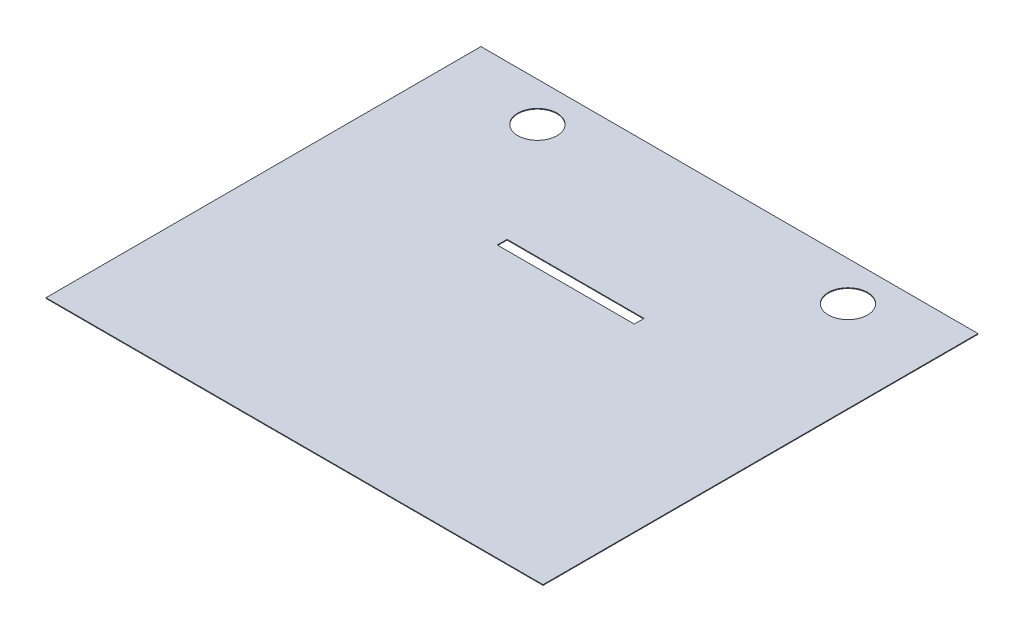
ISO-10303-21;
HEADER;
FILE_DESCRIPTION(('STEP AP214'),'2;1');
FILE_NAME('part.step','',(''),(''),'','','');
FILE_SCHEMA(('AUTOMOTIVE_DESIGN { 1 0 10303 214 1 1 1 1 }'));
ENDSEC;
DATA;
#1=APPLICATION_CONTEXT('core data for automotive mechanical design processes');
#2=APPLICATION_PROTOCOL_DEFINITION('international standard','automotive_design',2000,#1);
#3=PRODUCT_CONTEXT('',#1,'mechanical');
#4=PRODUCT('Part','Part','',(#3));
#5=PRODUCT_RELATED_PRODUCT_CATEGORY('part','',(#4));
#6=PRODUCT_DEFINITION_FORMATION('','',#4);
#7=PRODUCT_DEFINITION_CONTEXT('part definition',#1,'design');
#8=PRODUCT_DEFINITION('design','',#6,#7);
#9=PRODUCT_DEFINITION_SHAPE('','',#8);
#10=(LENGTH_UNIT() NAMED_UNIT(*) SI_UNIT(.MILLI.,.METRE.));
#11=(NAMED_UNIT(*) PLANE_ANGLE_UNIT() SI_UNIT($,.RADIAN.));
#12=(NAMED_UNIT(*) SI_UNIT($,.STERADIAN.) SOLID_ANGLE_UNIT());
#13=UNCERTAINTY_MEASURE_WITH_UNIT(LENGTH_MEASURE(1.E-05),#10,'distance_accuracy_value','');
#14=(GEOMETRIC_REPRESENTATION_CONTEXT(3) GLOBAL_UNCERTAINTY_ASSIGNED_CONTEXT((#13)) GLOBAL_UNIT_ASSIGNED_CONTEXT((#10,
#11,#12)) REPRESENTATION_CONTEXT('',''));
#15=CARTESIAN_POINT('',(0.,0.,0.));
#16=DIRECTION('',(0.,0.,1.));
#17=DIRECTION('',(1.,0.,0.));
#18=AXIS2_PLACEMENT_3D('',#15,#16,#17);
#19=CARTESIAN_POINT('',(0.,-0.07,-44.45));
#20=DIRECTION('',(-1.,0.,0.));
#21=DIRECTION('',(0.,0.,1.));
#22=AXIS2_PLACEMENT_3D('',#19,#20,#21);
#23=PLANE('',#22);
#24=DIRECTION('',(0.,0.,1.));
#25=VECTOR('',#24,1.);
#26=CARTESIAN_POINT('',(0.,0.,-44.45));
#27=LINE('',#26,#25);
#28=CARTESIAN_POINT('',(0.,0.,-44.45));
#29=VERTEX_POINT('',#28);
#30=CARTESIAN_POINT('',(0.,0.,0.));
#31=VERTEX_POINT('',#30);
#32=EDGE_CURVE('E166',#29,#31,#27,.T.);
#33=ORIENTED_EDGE('',*,*,#32,.F.);
#34=DIRECTION('',(0.,1.,0.));
#35=VECTOR('',#34,1.);
#36=CARTESIAN_POINT('',(0.,-0.07,-44.45));
#37=LINE('',#36,#35);
#38=CARTESIAN_POINT('',(0.,-0.07,-44.45));
#39=VERTEX_POINT('',#38);
#40=EDGE_CURVE('E11',#39,#29,#37,.T.);
#41=ORIENTED_EDGE('',*,*,#40,.F.);
#42=DIRECTION('',(0.,0.,1.));
#43=VECTOR('',#42,1.);
#44=CARTESIAN_POINT('',(0.,-0.07,-44.45));
#45=LINE('',#44,#43);
#46=CARTESIAN_POINT('',(0.,-0.07,0.));
#47=VERTEX_POINT('',#46);
#48=EDGE_CURVE('E170',#39,#47,#45,.T.);
#49=ORIENTED_EDGE('',*,*,#48,.T.);
#50=DIRECTION('',(0.,1.,0.));
#51=VECTOR('',#50,1.);
#52=CARTESIAN_POINT('',(0.,-0.07,0.));
#53=LINE('',#52,#51);
#54=EDGE_CURVE('E42',#47,#31,#53,.T.);
#55=ORIENTED_EDGE('',*,*,#54,.T.);
#56=EDGE_LOOP('',(#33,#41,#49,#55));
#57=FACE_BOUND('',#56,.T.);
#58=ADVANCED_FACE('F39',(#57),#23,.T.);
#59=CARTESIAN_POINT('',(0.,-0.07,-44.45));
#60=DIRECTION('',(0.,0.,-1.));
#61=DIRECTION('',(-1.,0.,0.));
#62=AXIS2_PLACEMENT_3D('',#59,#60,#61);
#63=PLANE('',#62);
#64=DIRECTION('',(-1.,0.,0.));
#65=VECTOR('',#64,1.);
#66=CARTESIAN_POINT('',(0.,0.,-44.45));
#67=LINE('',#66,#65);
#68=CARTESIAN_POINT('',(50.8,0.,-44.45));
#69=VERTEX_POINT('',#68);
#70=EDGE_CURVE('E175',#69,#29,#67,.T.);
#71=ORIENTED_EDGE('',*,*,#70,.F.);
#72=DIRECTION('',(0.,1.,0.));
#73=VECTOR('',#72,1.);
#74=CARTESIAN_POINT('',(50.8,-0.07,-44.45));
#75=LINE('',#74,#73);
#76=CARTESIAN_POINT('',(50.8,-0.07,-44.45));
#77=VERTEX_POINT('',#76);
#78=EDGE_CURVE('E48',#77,#69,#75,.T.);
#79=ORIENTED_EDGE('',*,*,#78,.F.);
#80=DIRECTION('',(-1.,0.,0.));
#81=VECTOR('',#80,1.);
#82=CARTESIAN_POINT('',(0.,-0.07,-44.45));
#83=LINE('',#82,#81);
#84=EDGE_CURVE('E183',#77,#39,#83,.T.);
#85=ORIENTED_EDGE('',*,*,#84,.T.);
#86=ORIENTED_EDGE('',*,*,#40,.T.);
#87=EDGE_LOOP('',(#71,#79,#85,#86));
#88=FACE_BOUND('',#87,.T.);
#89=ADVANCED_FACE('F217',(#88),#63,.T.);
#90=CARTESIAN_POINT('',(50.8,-0.07,-44.45));
#91=DIRECTION('',(1.,0.,0.));
#92=DIRECTION('',(0.,0.,-1.));
#93=AXIS2_PLACEMENT_3D('',#90,#91,#92);
#94=PLANE('',#93);
#95=DIRECTION('',(0.,0.,-1.));
#96=VECTOR('',#95,1.);
#97=CARTESIAN_POINT('',(50.8,0.,-44.45));
#98=LINE('',#97,#96);
#99=CARTESIAN_POINT('',(50.8,0.,0.));
#100=VERTEX_POINT('',#99);
#101=EDGE_CURVE('E194',#100,#69,#98,.T.);
#102=ORIENTED_EDGE('',*,*,#101,.F.);
#103=DIRECTION('',(0.,1.,0.));
#104=VECTOR('',#103,1.);
#105=CARTESIAN_POINT('',(50.8,-0.07,0.));
#106=LINE('',#105,#104);
#107=CARTESIAN_POINT('',(50.8,-0.07,0.));
#108=VERTEX_POINT('',#107);
#109=EDGE_CURVE('E202',#108,#100,#106,.T.);
#110=ORIENTED_EDGE('',*,*,#109,.F.);
#111=DIRECTION('',(0.,0.,-1.));
#112=VECTOR('',#111,1.);
#113=CARTESIAN_POINT('',(50.8,-0.07,-44.45));
#114=LINE('',#113,#112);
#115=EDGE_CURVE('E179',#108,#77,#114,.T.);
#116=ORIENTED_EDGE('',*,*,#115,.T.);
#117=ORIENTED_EDGE('',*,*,#78,.T.);
#118=EDGE_LOOP('',(#102,#110,#116,#117));
#119=FACE_BOUND('',#118,.T.);
#120=ADVANCED_FACE('F222',(#119),#94,.T.);
#121=CARTESIAN_POINT('',(0.,-0.07,0.));
#122=DIRECTION('',(0.,0.,1.));
#123=DIRECTION('',(1.,0.,0.));
#124=AXIS2_PLACEMENT_3D('',#121,#122,#123);
#125=PLANE('',#124);
#126=DIRECTION('',(1.,0.,0.));
#127=VECTOR('',#126,1.);
#128=CARTESIAN_POINT('',(0.,0.,0.));
#129=LINE('',#128,#127);
#130=EDGE_CURVE('E190',#31,#100,#129,.T.);
#131=ORIENTED_EDGE('',*,*,#130,.F.);
#132=ORIENTED_EDGE('',*,*,#54,.F.);
#133=DIRECTION('',(1.,0.,0.));
#134=VECTOR('',#133,1.);
#135=CARTESIAN_POINT('',(0.,-0.07,0.));
#136=LINE('',#135,#134);
#137=EDGE_CURVE('E174',#47,#108,#136,.T.);
#138=ORIENTED_EDGE('',*,*,#137,.T.);
#139=ORIENTED_EDGE('',*,*,#109,.T.);
#140=EDGE_LOOP('',(#131,#132,#138,#139));
#141=FACE_BOUND('',#140,.T.);
#142=ADVANCED_FACE('F212',(#141),#125,.T.);
#143=CARTESIAN_POINT('',(0.,-0.07,0.));
#144=DIRECTION('',(0.,1.,0.));
#145=DIRECTION('',(0.,0.,1.));
#146=AXIS2_PLACEMENT_3D('',#143,#144,#145);
#147=PLANE('',#146);
#148=DIRECTION('',(-1.,0.,0.));
#149=VECTOR('',#148,1.);
#150=CARTESIAN_POINT('',(18.4,-0.07,-28.725));
#151=LINE('',#150,#149);
#152=CARTESIAN_POINT('',(32.4,-0.07,-28.725));
#153=VERTEX_POINT('',#152);
#154=CARTESIAN_POINT('',(18.4,-0.07,-28.725));
#155=VERTEX_POINT('',#154);
#156=EDGE_CURVE('E114',#153,#155,#151,.T.);
#157=ORIENTED_EDGE('',*,*,#156,.T.);
#158=DIRECTION('',(0.,0.,1.));
#159=VECTOR('',#158,1.);
#160=CARTESIAN_POINT('',(18.4,-0.07,-28.725));
#161=LINE('',#160,#159);
#162=CARTESIAN_POINT('',(18.4,-0.07,-27.725));
#163=VERTEX_POINT('',#162);
#164=EDGE_CURVE('E107',#155,#163,#161,.T.);
#165=ORIENTED_EDGE('',*,*,#164,.T.);
#166=DIRECTION('',(1.,0.,0.));
#167=VECTOR('',#166,1.);
#168=CARTESIAN_POINT('',(18.4,-0.07,-27.725));
#169=LINE('',#168,#167);
#170=CARTESIAN_POINT('',(32.4,-0.07,-27.725));
#171=VERTEX_POINT('',#170);
#172=EDGE_CURVE('E117',#163,#171,#169,.T.);
#173=ORIENTED_EDGE('',*,*,#172,.T.);
#174=DIRECTION('',(0.,0.,-1.));
#175=VECTOR('',#174,1.);
#176=CARTESIAN_POINT('',(32.4,-0.07,-28.725));
#177=LINE('',#176,#175);
#178=EDGE_CURVE('E56',#171,#153,#177,.T.);
#179=ORIENTED_EDGE('',*,*,#178,.T.);
#180=EDGE_LOOP('',(#157,#165,#173,#179));
#181=FACE_BOUND('',#180,.T.);
#182=CARTESIAN_POINT('',(41.5128674030477,-0.07,-40.45));
#183=DIRECTION('',(0.,1.,0.));
#184=DIRECTION('',(0.,0.,1.));
#185=AXIS2_PLACEMENT_3D('',#182,#183,#184);
#186=CIRCLE('',#185,2.);
#187=CARTESIAN_POINT('',(41.5128674030477,-0.07,-38.45));
#188=VERTEX_POINT('',#187);
#189=EDGE_CURVE('E154',#188,#188,#186,.T.);
#190=ORIENTED_EDGE('',*,*,#189,.T.);
#191=EDGE_LOOP('',(#190));
#192=FACE_BOUND('',#191,.T.);
#193=CARTESIAN_POINT('',(9.77268378326401,-0.07,-40.45));
#194=DIRECTION('',(0.,1.,0.));
#195=DIRECTION('',(0.,0.,1.));
#196=AXIS2_PLACEMENT_3D('',#193,#194,#195);
#197=CIRCLE('',#196,2.00128013533751);
#198=CARTESIAN_POINT('',(9.77268378326401,-0.07,-38.4487198646625));
#199=VERTEX_POINT('',#198);
#200=EDGE_CURVE('E162',#199,#199,#197,.T.);
#201=ORIENTED_EDGE('',*,*,#200,.T.);
#202=EDGE_LOOP('',(#201));
#203=FACE_BOUND('',#202,.T.);
#204=ORIENTED_EDGE('',*,*,#48,.F.);
#205=ORIENTED_EDGE('',*,*,#84,.F.);
#206=ORIENTED_EDGE('',*,*,#115,.F.);
#207=ORIENTED_EDGE('',*,*,#137,.F.);
#208=EDGE_LOOP('',(#204,#205,#206,#207));
#209=FACE_BOUND('',#208,.T.);
#210=ADVANCED_FACE('F122',(#181,#192,#203,#209),#147,.F.);
#211=CARTESIAN_POINT('',(0.,0.,0.));
#212=DIRECTION('',(0.,1.,0.));
#213=DIRECTION('',(0.,0.,1.));
#214=AXIS2_PLACEMENT_3D('',#211,#212,#213);
#215=PLANE('',#214);
#216=DIRECTION('',(0.,0.,1.));
#217=VECTOR('',#216,1.);
#218=CARTESIAN_POINT('',(18.4,0.,-28.725));
#219=LINE('',#218,#217);
#220=CARTESIAN_POINT('',(18.4,0.,-28.725));
#221=VERTEX_POINT('',#220);
#222=CARTESIAN_POINT('',(18.4,0.,-27.725));
#223=VERTEX_POINT('',#222);
#224=EDGE_CURVE('E64',#221,#223,#219,.T.);
#225=ORIENTED_EDGE('',*,*,#224,.F.);
#226=DIRECTION('',(-1.,0.,0.));
#227=VECTOR('',#226,1.);
#228=CARTESIAN_POINT('',(18.4,0.,-28.725));
#229=LINE('',#228,#227);
#230=CARTESIAN_POINT('',(32.4,0.,-28.725));
#231=VERTEX_POINT('',#230);
#232=EDGE_CURVE('E126',#231,#221,#229,.T.);
#233=ORIENTED_EDGE('',*,*,#232,.F.);
#234=DIRECTION('',(0.,0.,-1.));
#235=VECTOR('',#234,1.);
#236=CARTESIAN_POINT('',(32.4,0.,-28.725));
#237=LINE('',#236,#235);
#238=CARTESIAN_POINT('',(32.4,0.,-27.725));
#239=VERTEX_POINT('',#238);
#240=EDGE_CURVE('E130',#239,#231,#237,.T.);
#241=ORIENTED_EDGE('',*,*,#240,.F.);
#242=DIRECTION('',(1.,0.,0.));
#243=VECTOR('',#242,1.);
#244=CARTESIAN_POINT('',(18.4,0.,-27.725));
#245=LINE('',#244,#243);
#246=EDGE_CURVE('E139',#223,#239,#245,.T.);
#247=ORIENTED_EDGE('',*,*,#246,.F.);
#248=EDGE_LOOP('',(#225,#233,#241,#247));
#249=FACE_BOUND('',#248,.T.);
#250=CARTESIAN_POINT('',(41.5128674030477,0.,-40.45));
#251=DIRECTION('',(0.,1.,0.));
#252=DIRECTION('',(0.,0.,1.));
#253=AXIS2_PLACEMENT_3D('',#250,#251,#252);
#254=CIRCLE('',#253,2.);
#255=CARTESIAN_POINT('',(41.5128674030477,0.,-38.45));
#256=VERTEX_POINT('',#255);
#257=EDGE_CURVE('E148',#256,#256,#254,.T.);
#258=ORIENTED_EDGE('',*,*,#257,.F.);
#259=EDGE_LOOP('',(#258));
#260=FACE_BOUND('',#259,.T.);
#261=CARTESIAN_POINT('',(9.77268378326401,0.,-40.45));
#262=DIRECTION('',(0.,1.,0.));
#263=DIRECTION('',(0.,0.,1.));
#264=AXIS2_PLACEMENT_3D('',#261,#262,#263);
#265=CIRCLE('',#264,2.00128013533751);
#266=CARTESIAN_POINT('',(9.77268378326401,0.,-38.4487198646625));
#267=VERTEX_POINT('',#266);
#268=EDGE_CURVE('E158',#267,#267,#265,.T.);
#269=ORIENTED_EDGE('',*,*,#268,.F.);
#270=EDGE_LOOP('',(#269));
#271=FACE_BOUND('',#270,.T.);
#272=ORIENTED_EDGE('',*,*,#32,.T.);
#273=ORIENTED_EDGE('',*,*,#130,.T.);
#274=ORIENTED_EDGE('',*,*,#101,.T.);
#275=ORIENTED_EDGE('',*,*,#70,.T.);
#276=EDGE_LOOP('',(#272,#273,#274,#275));
#277=FACE_BOUND('',#276,.T.);
#278=ADVANCED_FACE('F214',(#249,#260,#271,#277),#215,.T.);
#279=CARTESIAN_POINT('',(9.77268378326401,-0.07,-40.45));
#280=DIRECTION('',(0.,1.,0.));
#281=DIRECTION('',(0.,0.,1.));
#282=AXIS2_PLACEMENT_3D('',#279,#280,#281);
#283=CYLINDRICAL_SURFACE('',#282,2.00128013533751);
#284=ORIENTED_EDGE('',*,*,#200,.F.);
#285=EDGE_LOOP('',(#284));
#286=FACE_BOUND('',#285,.T.);
#287=ORIENTED_EDGE('',*,*,#268,.T.);
#288=EDGE_LOOP('',(#287));
#289=FACE_BOUND('',#288,.T.);
#290=ADVANCED_FACE('F264',(#286,#289),#283,.F.);
#291=CARTESIAN_POINT('',(41.5128674030477,-0.07,-40.45));
#292=DIRECTION('',(0.,1.,0.));
#293=DIRECTION('',(0.,0.,1.));
#294=AXIS2_PLACEMENT_3D('',#291,#292,#293);
#295=CYLINDRICAL_SURFACE('',#294,2.);
#296=ORIENTED_EDGE('',*,*,#189,.F.);
#297=EDGE_LOOP('',(#296));
#298=FACE_BOUND('',#297,.T.);
#299=ORIENTED_EDGE('',*,*,#257,.T.);
#300=EDGE_LOOP('',(#299));
#301=FACE_BOUND('',#300,.T.);
#302=ADVANCED_FACE('F274',(#298,#301),#295,.F.);
#303=CARTESIAN_POINT('',(18.4,-0.07,-28.725));
#304=DIRECTION('',(-1.,0.,0.));
#305=DIRECTION('',(0.,0.,1.));
#306=AXIS2_PLACEMENT_3D('',#303,#304,#305);
#307=PLANE('',#306);
#308=ORIENTED_EDGE('',*,*,#224,.T.);
#309=DIRECTION('',(0.,1.,0.));
#310=VECTOR('',#309,1.);
#311=CARTESIAN_POINT('',(18.4,-0.07,-27.725));
#312=LINE('',#311,#310);
#313=EDGE_CURVE('E103',#163,#223,#312,.T.);
#314=ORIENTED_EDGE('',*,*,#313,.F.);
#315=ORIENTED_EDGE('',*,*,#164,.F.);
#316=DIRECTION('',(0.,1.,0.));
#317=VECTOR('',#316,1.);
#318=CARTESIAN_POINT('',(18.4,-0.07,-28.725));
#319=LINE('',#318,#317);
#320=EDGE_CURVE('E145',#155,#221,#319,.T.);
#321=ORIENTED_EDGE('',*,*,#320,.T.);
#322=EDGE_LOOP('',(#308,#314,#315,#321));
#323=FACE_BOUND('',#322,.T.);
#324=ADVANCED_FACE('F105',(#323),#307,.F.);
#325=CARTESIAN_POINT('',(18.4,-0.07,-28.725));
#326=DIRECTION('',(0.,0.,-1.));
#327=DIRECTION('',(-1.,0.,0.));
#328=AXIS2_PLACEMENT_3D('',#325,#326,#327);
#329=PLANE('',#328);
#330=ORIENTED_EDGE('',*,*,#232,.T.);
#331=ORIENTED_EDGE('',*,*,#320,.F.);
#332=ORIENTED_EDGE('',*,*,#156,.F.);
#333=DIRECTION('',(0.,1.,0.));
#334=VECTOR('',#333,1.);
#335=CARTESIAN_POINT('',(32.4,-0.07,-28.725));
#336=LINE('',#335,#334);
#337=EDGE_CURVE('E149',#153,#231,#336,.T.);
#338=ORIENTED_EDGE('',*,*,#337,.T.);
#339=EDGE_LOOP('',(#330,#331,#332,#338));
#340=FACE_BOUND('',#339,.T.);
#341=ADVANCED_FACE('F293',(#340),#329,.F.);
#342=CARTESIAN_POINT('',(32.4,-0.07,-28.725));
#343=DIRECTION('',(1.,0.,0.));
#344=DIRECTION('',(0.,0.,-1.));
#345=AXIS2_PLACEMENT_3D('',#342,#343,#344);
#346=PLANE('',#345);
#347=ORIENTED_EDGE('',*,*,#240,.T.);
#348=ORIENTED_EDGE('',*,*,#337,.F.);
#349=ORIENTED_EDGE('',*,*,#178,.F.);
#350=DIRECTION('',(0.,1.,0.));
#351=VECTOR('',#350,1.);
#352=CARTESIAN_POINT('',(32.4,-0.07,-27.725));
#353=LINE('',#352,#351);
#354=EDGE_CURVE('E113',#171,#239,#353,.T.);
#355=ORIENTED_EDGE('',*,*,#354,.T.);
#356=EDGE_LOOP('',(#347,#348,#349,#355));
#357=FACE_BOUND('',#356,.T.);
#358=ADVANCED_FACE('F302',(#357),#346,.F.);
#359=CARTESIAN_POINT('',(18.4,-0.07,-27.725));
#360=DIRECTION('',(0.,0.,1.));
#361=DIRECTION('',(1.,0.,0.));
#362=AXIS2_PLACEMENT_3D('',#359,#360,#361);
#363=PLANE('',#362);
#364=ORIENTED_EDGE('',*,*,#246,.T.);
#365=ORIENTED_EDGE('',*,*,#354,.F.);
#366=ORIENTED_EDGE('',*,*,#172,.F.);
#367=ORIENTED_EDGE('',*,*,#313,.T.);
#368=EDGE_LOOP('',(#364,#365,#366,#367));
#369=FACE_BOUND('',#368,.T.);
#370=ADVANCED_FACE('F118',(#369),#363,.F.);
#371=CLOSED_SHELL('',(#58,#89,#120,#142,#210,#278,#290,#302,#324,#341,#358,#370));
#372=MANIFOLD_SOLID_BREP('B2',#371);
#373=ADVANCED_BREP_SHAPE_REPRESENTATION('',(#18,#372),#14);
#374=SHAPE_DEFINITION_REPRESENTATION(#9,#373);
ENDSEC;
END-ISO-10303-21;
